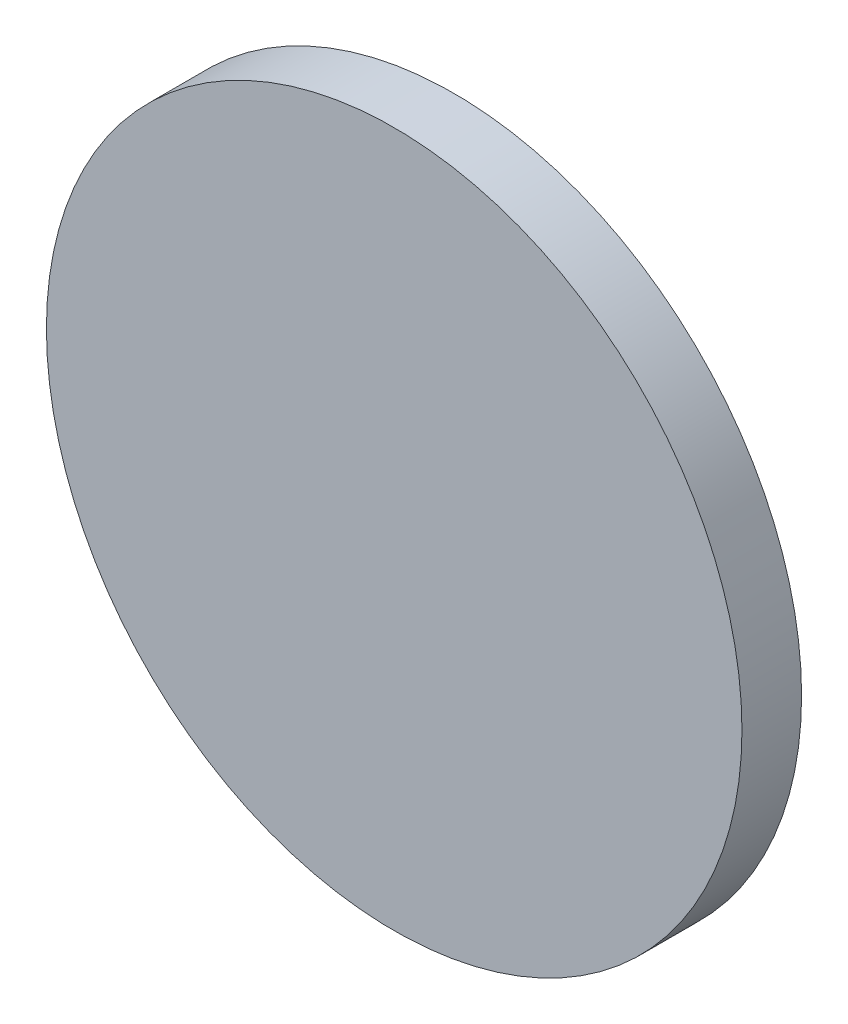
ISO-10303-21;
HEADER;
FILE_DESCRIPTION(('STEP AP214'),'2;1');
FILE_NAME('part.step','',(''),(''),'','','');
FILE_SCHEMA(('AUTOMOTIVE_DESIGN { 1 0 10303 214 1 1 1 1 }'));
ENDSEC;
DATA;
#1=APPLICATION_CONTEXT('core data for automotive mechanical design processes');
#2=APPLICATION_PROTOCOL_DEFINITION('international standard','automotive_design',2000,#1);
#3=PRODUCT_CONTEXT('',#1,'mechanical');
#4=PRODUCT('Part','Part','',(#3));
#5=PRODUCT_RELATED_PRODUCT_CATEGORY('part','',(#4));
#6=PRODUCT_DEFINITION_FORMATION('','',#4);
#7=PRODUCT_DEFINITION_CONTEXT('part definition',#1,'design');
#8=PRODUCT_DEFINITION('design','',#6,#7);
#9=PRODUCT_DEFINITION_SHAPE('','',#8);
#10=(LENGTH_UNIT() NAMED_UNIT(*) SI_UNIT(.MILLI.,.METRE.));
#11=(NAMED_UNIT(*) PLANE_ANGLE_UNIT() SI_UNIT($,.RADIAN.));
#12=(NAMED_UNIT(*) SI_UNIT($,.STERADIAN.) SOLID_ANGLE_UNIT());
#13=UNCERTAINTY_MEASURE_WITH_UNIT(LENGTH_MEASURE(1.E-05),#10,'distance_accuracy_value','');
#14=(GEOMETRIC_REPRESENTATION_CONTEXT(3) GLOBAL_UNCERTAINTY_ASSIGNED_CONTEXT((#13)) GLOBAL_UNIT_ASSIGNED_CONTEXT((#10,
#11,#12)) REPRESENTATION_CONTEXT('',''));
#15=CARTESIAN_POINT('',(0.,0.,0.));
#16=DIRECTION('',(0.,0.,1.));
#17=DIRECTION('',(1.,0.,0.));
#18=AXIS2_PLACEMENT_3D('',#15,#16,#17);
#19=CARTESIAN_POINT('',(3.07848,7.211060006176,0.03429));
#20=DIRECTION('',(0.,0.,1.));
#21=DIRECTION('',(1.,0.,0.));
#22=AXIS2_PLACEMENT_3D('',#19,#20,#21);
#23=PLANE('',#22);
#24=CARTESIAN_POINT('',(3.07848,7.211060006176,0.03429));
#25=DIRECTION('',(0.,0.,1.));
#26=DIRECTION('',(1.,0.,0.));
#27=AXIS2_PLACEMENT_3D('',#24,#25,#26);
#28=CIRCLE('',#27,0.200024667);
#29=CARTESIAN_POINT('',(3.278504667,7.211060006176,0.03429));
#30=VERTEX_POINT('',#29);
#31=EDGE_CURVE('E18',#30,#30,#28,.F.);
#32=ORIENTED_EDGE('',*,*,#31,.F.);
#33=EDGE_LOOP('',(#32));
#34=FACE_BOUND('',#33,.T.);
#35=ADVANCED_FACE('F15',(#34),#23,.T.);
#36=CARTESIAN_POINT('',(3.07848,7.211060006176,0.));
#37=DIRECTION('',(0.,0.,1.));
#38=DIRECTION('',(1.,0.,0.));
#39=AXIS2_PLACEMENT_3D('',#36,#37,#38);
#40=CYLINDRICAL_SURFACE('',#39,0.200024667);
#41=ORIENTED_EDGE('',*,*,#31,.T.);
#42=EDGE_LOOP('',(#41));
#43=FACE_BOUND('',#42,.T.);
#44=CARTESIAN_POINT('',(3.07848,7.211060006176,0.));
#45=DIRECTION('',(0.,0.,1.));
#46=DIRECTION('',(1.,0.,0.));
#47=AXIS2_PLACEMENT_3D('',#44,#45,#46);
#48=CIRCLE('',#47,0.200024667);
#49=CARTESIAN_POINT('',(3.278504667,7.211060006176,0.));
#50=VERTEX_POINT('',#49);
#51=EDGE_CURVE('E10',#50,#50,#48,.F.);
#52=ORIENTED_EDGE('',*,*,#51,.F.);
#53=EDGE_LOOP('',(#52));
#54=FACE_BOUND('',#53,.T.);
#55=ADVANCED_FACE('F27',(#43,#54),#40,.T.);
#56=CARTESIAN_POINT('',(3.07848,7.211060006176,0.));
#57=DIRECTION('',(0.,0.,-1.));
#58=DIRECTION('',(-1.,0.,0.));
#59=AXIS2_PLACEMENT_3D('',#56,#57,#58);
#60=PLANE('',#59);
#61=ORIENTED_EDGE('',*,*,#51,.T.);
#62=EDGE_LOOP('',(#61));
#63=FACE_BOUND('',#62,.T.);
#64=ADVANCED_FACE('F35',(#63),#60,.T.);
#65=CLOSED_SHELL('',(#35,#55,#64));
#66=MANIFOLD_SOLID_BREP('B1',#65);
#67=ADVANCED_BREP_SHAPE_REPRESENTATION('',(#18,#66),#14);
#68=SHAPE_DEFINITION_REPRESENTATION(#9,#67);
ENDSEC;
END-ISO-10303-21;
